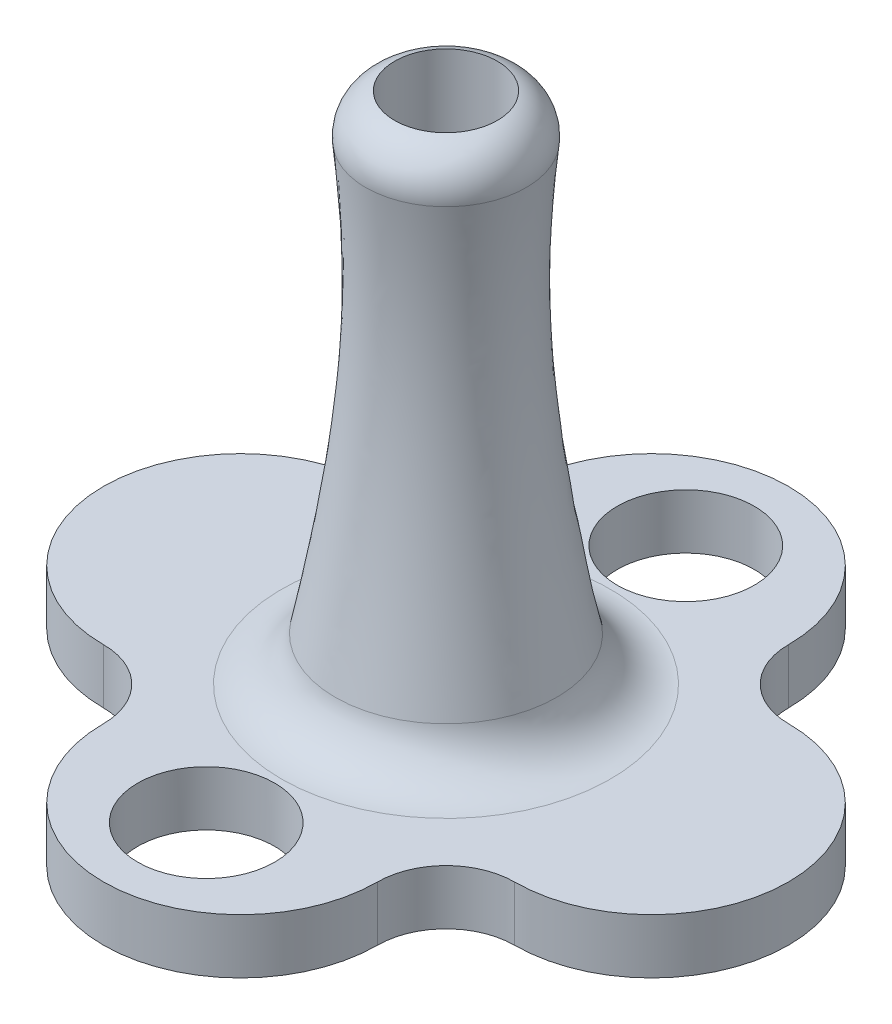
ISO-10303-21;
HEADER;
FILE_DESCRIPTION(('STEP AP214'),'2;1');
FILE_NAME('part.step','',(''),(''),'','','');
FILE_SCHEMA(('AUTOMOTIVE_DESIGN { 1 0 10303 214 1 1 1 1 }'));
ENDSEC;
DATA;
#1=APPLICATION_CONTEXT('core data for automotive mechanical design processes');
#2=APPLICATION_PROTOCOL_DEFINITION('international standard','automotive_design',2000,#1);
#3=PRODUCT_CONTEXT('',#1,'mechanical');
#4=PRODUCT('Part','Part','',(#3));
#5=PRODUCT_RELATED_PRODUCT_CATEGORY('part','',(#4));
#6=PRODUCT_DEFINITION_FORMATION('','',#4);
#7=PRODUCT_DEFINITION_CONTEXT('part definition',#1,'design');
#8=PRODUCT_DEFINITION('design','',#6,#7);
#9=PRODUCT_DEFINITION_SHAPE('','',#8);
#10=(LENGTH_UNIT() NAMED_UNIT(*) SI_UNIT(.MILLI.,.METRE.));
#11=(NAMED_UNIT(*) PLANE_ANGLE_UNIT() SI_UNIT($,.RADIAN.));
#12=(NAMED_UNIT(*) SI_UNIT($,.STERADIAN.) SOLID_ANGLE_UNIT());
#13=UNCERTAINTY_MEASURE_WITH_UNIT(LENGTH_MEASURE(1.E-05),#10,'distance_accuracy_value','');
#14=(GEOMETRIC_REPRESENTATION_CONTEXT(3) GLOBAL_UNCERTAINTY_ASSIGNED_CONTEXT((#13)) GLOBAL_UNIT_ASSIGNED_CONTEXT((#10,
#11,#12)) REPRESENTATION_CONTEXT('',''));
#15=CARTESIAN_POINT('',(0.,0.,0.));
#16=DIRECTION('',(0.,0.,1.));
#17=DIRECTION('',(1.,0.,0.));
#18=AXIS2_PLACEMENT_3D('',#15,#16,#17);
#19=CARTESIAN_POINT('',(0.,2.032,7.61999999999999));
#20=DIRECTION('',(0.,1.,0.));
#21=DIRECTION('',(0.,0.,1.));
#22=AXIS2_PLACEMENT_3D('',#19,#20,#21);
#23=PLANE('',#22);
#24=CARTESIAN_POINT('',(0.,2.032,0.));
#25=DIRECTION('',(0.,1.,0.));
#26=DIRECTION('',(0.,0.,1.));
#27=AXIS2_PLACEMENT_3D('',#24,#25,#26);
#28=CIRCLE('',#27,6.09672311357425);
#29=CARTESIAN_POINT('',(0.,2.032,6.09672311357425));
#30=VERTEX_POINT('',#29);
#31=EDGE_CURVE('E45',#30,#30,#28,.F.);
#32=ORIENTED_EDGE('',*,*,#31,.T.);
#33=EDGE_LOOP('',(#32));
#34=FACE_BOUND('',#33,.T.);
#35=CARTESIAN_POINT('',(0.,2.032,8.88999999999999));
#36=DIRECTION('',(0.,1.,0.));
#37=DIRECTION('',(0.,0.,-1.));
#38=AXIS2_PLACEMENT_3D('',#35,#36,#37);
#39=CIRCLE('',#38,2.54);
#40=CARTESIAN_POINT('',(0.,2.032,6.34999999999999));
#41=VERTEX_POINT('',#40);
#42=EDGE_CURVE('E258',#41,#41,#39,.T.);
#43=ORIENTED_EDGE('',*,*,#42,.F.);
#44=EDGE_LOOP('',(#43));
#45=FACE_BOUND('',#44,.T.);
#46=CARTESIAN_POINT('',(0.,2.032,-8.88999999999999));
#47=DIRECTION('',(0.,1.,0.));
#48=DIRECTION('',(0.,0.,1.));
#49=AXIS2_PLACEMENT_3D('',#46,#47,#48);
#50=CIRCLE('',#49,2.54);
#51=CARTESIAN_POINT('',(0.,2.032,-6.34999999999999));
#52=VERTEX_POINT('',#51);
#53=EDGE_CURVE('E252',#52,#52,#50,.T.);
#54=ORIENTED_EDGE('',*,*,#53,.F.);
#55=EDGE_LOOP('',(#54));
#56=FACE_BOUND('',#55,.T.);
#57=CARTESIAN_POINT('',(0.,2.032,7.61999999999999));
#58=DIRECTION('',(0.,1.,0.));
#59=DIRECTION('',(0.,0.,1.));
#60=AXIS2_PLACEMENT_3D('',#57,#58,#59);
#61=CIRCLE('',#60,5.08);
#62=CARTESIAN_POINT('',(-5.08,2.032,7.61999999999999));
#63=VERTEX_POINT('',#62);
#64=CARTESIAN_POINT('',(5.08,2.032,7.61999999999999));
#65=VERTEX_POINT('',#64);
#66=EDGE_CURVE('E92',#63,#65,#61,.T.);
#67=ORIENTED_EDGE('',*,*,#66,.T.);
#68=CARTESIAN_POINT('',(7.62,2.032,7.62));
#69=DIRECTION('',(0.,1.,0.));
#70=DIRECTION('',(0.,0.,1.));
#71=AXIS2_PLACEMENT_3D('',#68,#69,#70);
#72=CIRCLE('',#71,2.54);
#73=CARTESIAN_POINT('',(7.61999999999999,2.032,5.08));
#74=VERTEX_POINT('',#73);
#75=EDGE_CURVE('E149',#65,#74,#72,.F.);
#76=ORIENTED_EDGE('',*,*,#75,.T.);
#77=CARTESIAN_POINT('',(7.61999999999999,2.032,0.));
#78=DIRECTION('',(0.,1.,0.));
#79=DIRECTION('',(0.,0.,1.));
#80=AXIS2_PLACEMENT_3D('',#77,#78,#79);
#81=CIRCLE('',#80,5.08);
#82=CARTESIAN_POINT('',(7.61999999999999,2.032,-5.08));
#83=VERTEX_POINT('',#82);
#84=EDGE_CURVE('E221',#74,#83,#81,.T.);
#85=ORIENTED_EDGE('',*,*,#84,.T.);
#86=CARTESIAN_POINT('',(7.62,2.032,-7.62));
#87=DIRECTION('',(0.,1.,0.));
#88=DIRECTION('',(0.,0.,1.));
#89=AXIS2_PLACEMENT_3D('',#86,#87,#88);
#90=CIRCLE('',#89,2.54);
#91=CARTESIAN_POINT('',(5.08,2.032,-7.61999999999999));
#92=VERTEX_POINT('',#91);
#93=EDGE_CURVE('E153',#83,#92,#90,.F.);
#94=ORIENTED_EDGE('',*,*,#93,.T.);
#95=CARTESIAN_POINT('',(0.,2.032,-7.61999999999999));
#96=DIRECTION('',(0.,1.,0.));
#97=DIRECTION('',(0.,0.,1.));
#98=AXIS2_PLACEMENT_3D('',#95,#96,#97);
#99=CIRCLE('',#98,5.08);
#100=CARTESIAN_POINT('',(-5.08,2.032,-7.61999999999999));
#101=VERTEX_POINT('',#100);
#102=EDGE_CURVE('E111',#92,#101,#99,.T.);
#103=ORIENTED_EDGE('',*,*,#102,.T.);
#104=CARTESIAN_POINT('',(-7.62,2.032,-7.62));
#105=DIRECTION('',(0.,1.,0.));
#106=DIRECTION('',(0.,0.,1.));
#107=AXIS2_PLACEMENT_3D('',#104,#105,#106);
#108=CIRCLE('',#107,2.54);
#109=CARTESIAN_POINT('',(-7.61999999999999,2.032,-5.08));
#110=VERTEX_POINT('',#109);
#111=EDGE_CURVE('E106',#101,#110,#108,.F.);
#112=ORIENTED_EDGE('',*,*,#111,.T.);
#113=CARTESIAN_POINT('',(-7.61999999999999,2.032,0.));
#114=DIRECTION('',(0.,1.,0.));
#115=DIRECTION('',(0.,0.,1.));
#116=AXIS2_PLACEMENT_3D('',#113,#114,#115);
#117=CIRCLE('',#116,5.08);
#118=CARTESIAN_POINT('',(-7.61999999999999,2.032,5.08));
#119=VERTEX_POINT('',#118);
#120=EDGE_CURVE('E108',#110,#119,#117,.T.);
#121=ORIENTED_EDGE('',*,*,#120,.T.);
#122=CARTESIAN_POINT('',(-7.62,2.032,7.62));
#123=DIRECTION('',(0.,1.,0.));
#124=DIRECTION('',(0.,0.,1.));
#125=AXIS2_PLACEMENT_3D('',#122,#123,#124);
#126=CIRCLE('',#125,2.54);
#127=EDGE_CURVE('E53',#119,#63,#126,.F.);
#128=ORIENTED_EDGE('',*,*,#127,.T.);
#129=EDGE_LOOP('',(#67,#76,#85,#94,#103,#112,#121,#128));
#130=FACE_BOUND('',#129,.T.);
#131=ADVANCED_FACE('F36',(#34,#45,#56,#130),#23,.T.);
#132=CARTESIAN_POINT('',(0.,2.032,7.61999999999999));
#133=DIRECTION('',(0.,-1.,0.));
#134=DIRECTION('',(0.,0.,-1.));
#135=AXIS2_PLACEMENT_3D('',#132,#133,#134);
#136=CYLINDRICAL_SURFACE('',#135,5.08);
#137=CARTESIAN_POINT('',(0.,0.,7.61999999999999));
#138=DIRECTION('',(0.,1.,0.));
#139=DIRECTION('',(0.,0.,1.));
#140=AXIS2_PLACEMENT_3D('',#137,#138,#139);
#141=CIRCLE('',#140,5.08);
#142=CARTESIAN_POINT('',(-5.08,0.,7.61999999999999));
#143=VERTEX_POINT('',#142);
#144=CARTESIAN_POINT('',(5.08,0.,7.61999999999999));
#145=VERTEX_POINT('',#144);
#146=EDGE_CURVE('E232',#143,#145,#141,.T.);
#147=ORIENTED_EDGE('',*,*,#146,.T.);
#148=DIRECTION('',(0.,-1.,0.));
#149=VECTOR('',#148,1.);
#150=CARTESIAN_POINT('',(5.08,2.032,7.61999999999999));
#151=LINE('',#150,#149);
#152=EDGE_CURVE('E141',#65,#145,#151,.T.);
#153=ORIENTED_EDGE('',*,*,#152,.F.);
#154=ORIENTED_EDGE('',*,*,#66,.F.);
#155=DIRECTION('',(0.,-1.,0.));
#156=VECTOR('',#155,1.);
#157=CARTESIAN_POINT('',(-5.08,2.032,7.61999999999999));
#158=LINE('',#157,#156);
#159=EDGE_CURVE('E123',#63,#143,#158,.T.);
#160=ORIENTED_EDGE('',*,*,#159,.T.);
#161=EDGE_LOOP('',(#147,#153,#154,#160));
#162=FACE_BOUND('',#161,.T.);
#163=ADVANCED_FACE('F188',(#162),#136,.T.);
#164=CARTESIAN_POINT('',(7.61999999999999,2.032,0.));
#165=DIRECTION('',(0.,-1.,0.));
#166=DIRECTION('',(0.,0.,-1.));
#167=AXIS2_PLACEMENT_3D('',#164,#165,#166);
#168=CYLINDRICAL_SURFACE('',#167,5.08);
#169=CARTESIAN_POINT('',(7.61999999999999,0.,0.));
#170=DIRECTION('',(0.,1.,0.));
#171=DIRECTION('',(0.,0.,1.));
#172=AXIS2_PLACEMENT_3D('',#169,#170,#171);
#173=CIRCLE('',#172,5.08);
#174=CARTESIAN_POINT('',(7.61999999999999,0.,5.08));
#175=VERTEX_POINT('',#174);
#176=CARTESIAN_POINT('',(7.61999999999999,0.,-5.08));
#177=VERTEX_POINT('',#176);
#178=EDGE_CURVE('E235',#175,#177,#173,.T.);
#179=ORIENTED_EDGE('',*,*,#178,.T.);
#180=DIRECTION('',(0.,-1.,0.));
#181=VECTOR('',#180,1.);
#182=CARTESIAN_POINT('',(7.61999999999999,2.032,-5.08));
#183=LINE('',#182,#181);
#184=EDGE_CURVE('E135',#83,#177,#183,.T.);
#185=ORIENTED_EDGE('',*,*,#184,.F.);
#186=ORIENTED_EDGE('',*,*,#84,.F.);
#187=DIRECTION('',(0.,-1.,0.));
#188=VECTOR('',#187,1.);
#189=CARTESIAN_POINT('',(7.61999999999999,2.032,5.08));
#190=LINE('',#189,#188);
#191=EDGE_CURVE('E138',#74,#175,#190,.T.);
#192=ORIENTED_EDGE('',*,*,#191,.T.);
#193=EDGE_LOOP('',(#179,#185,#186,#192));
#194=FACE_BOUND('',#193,.T.);
#195=ADVANCED_FACE('F192',(#194),#168,.T.);
#196=CARTESIAN_POINT('',(0.,2.032,-7.61999999999999));
#197=DIRECTION('',(0.,-1.,0.));
#198=DIRECTION('',(0.,0.,-1.));
#199=AXIS2_PLACEMENT_3D('',#196,#197,#198);
#200=CYLINDRICAL_SURFACE('',#199,5.08);
#201=CARTESIAN_POINT('',(0.,0.,-7.61999999999999));
#202=DIRECTION('',(0.,1.,0.));
#203=DIRECTION('',(0.,0.,1.));
#204=AXIS2_PLACEMENT_3D('',#201,#202,#203);
#205=CIRCLE('',#204,5.08);
#206=CARTESIAN_POINT('',(5.08,0.,-7.61999999999999));
#207=VERTEX_POINT('',#206);
#208=CARTESIAN_POINT('',(-5.08,0.,-7.61999999999999));
#209=VERTEX_POINT('',#208);
#210=EDGE_CURVE('E238',#207,#209,#205,.T.);
#211=ORIENTED_EDGE('',*,*,#210,.T.);
#212=DIRECTION('',(0.,-1.,0.));
#213=VECTOR('',#212,1.);
#214=CARTESIAN_POINT('',(-5.08,2.032,-7.61999999999999));
#215=LINE('',#214,#213);
#216=EDGE_CURVE('E126',#101,#209,#215,.T.);
#217=ORIENTED_EDGE('',*,*,#216,.F.);
#218=ORIENTED_EDGE('',*,*,#102,.F.);
#219=DIRECTION('',(0.,-1.,0.));
#220=VECTOR('',#219,1.);
#221=CARTESIAN_POINT('',(5.08,2.032,-7.61999999999999));
#222=LINE('',#221,#220);
#223=EDGE_CURVE('E128',#92,#207,#222,.T.);
#224=ORIENTED_EDGE('',*,*,#223,.T.);
#225=EDGE_LOOP('',(#211,#217,#218,#224));
#226=FACE_BOUND('',#225,.T.);
#227=ADVANCED_FACE('F202',(#226),#200,.T.);
#228=CARTESIAN_POINT('',(-7.61999999999999,2.032,0.));
#229=DIRECTION('',(0.,-1.,0.));
#230=DIRECTION('',(0.,0.,-1.));
#231=AXIS2_PLACEMENT_3D('',#228,#229,#230);
#232=CYLINDRICAL_SURFACE('',#231,5.08);
#233=CARTESIAN_POINT('',(-7.61999999999999,0.,0.));
#234=DIRECTION('',(0.,1.,0.));
#235=DIRECTION('',(0.,0.,1.));
#236=AXIS2_PLACEMENT_3D('',#233,#234,#235);
#237=CIRCLE('',#236,5.08);
#238=CARTESIAN_POINT('',(-7.61999999999999,0.,-5.08));
#239=VERTEX_POINT('',#238);
#240=CARTESIAN_POINT('',(-7.61999999999999,0.,5.08));
#241=VERTEX_POINT('',#240);
#242=EDGE_CURVE('E228',#239,#241,#237,.T.);
#243=ORIENTED_EDGE('',*,*,#242,.T.);
#244=DIRECTION('',(0.,-1.,0.));
#245=VECTOR('',#244,1.);
#246=CARTESIAN_POINT('',(-7.61999999999999,2.032,5.08));
#247=LINE('',#246,#245);
#248=EDGE_CURVE('E122',#119,#241,#247,.T.);
#249=ORIENTED_EDGE('',*,*,#248,.F.);
#250=ORIENTED_EDGE('',*,*,#120,.F.);
#251=DIRECTION('',(0.,-1.,0.));
#252=VECTOR('',#251,1.);
#253=CARTESIAN_POINT('',(-7.61999999999999,2.032,-5.08));
#254=LINE('',#253,#252);
#255=EDGE_CURVE('E121',#110,#239,#254,.T.);
#256=ORIENTED_EDGE('',*,*,#255,.T.);
#257=EDGE_LOOP('',(#243,#249,#250,#256));
#258=FACE_BOUND('',#257,.T.);
#259=ADVANCED_FACE('F120',(#258),#232,.T.);
#260=CARTESIAN_POINT('',(0.,0.,7.61999999999999));
#261=DIRECTION('',(0.,1.,0.));
#262=DIRECTION('',(0.,0.,1.));
#263=AXIS2_PLACEMENT_3D('',#260,#261,#262);
#264=PLANE('',#263);
#265=CARTESIAN_POINT('',(0.,0.,8.88999999999999));
#266=DIRECTION('',(0.,1.,0.));
#267=DIRECTION('',(0.,0.,1.));
#268=AXIS2_PLACEMENT_3D('',#265,#266,#267);
#269=CIRCLE('',#268,2.54);
#270=CARTESIAN_POINT('',(0.,0.,11.43));
#271=VERTEX_POINT('',#270);
#272=EDGE_CURVE('E255',#271,#271,#269,.F.);
#273=ORIENTED_EDGE('',*,*,#272,.F.);
#274=EDGE_LOOP('',(#273));
#275=FACE_BOUND('',#274,.T.);
#276=CARTESIAN_POINT('',(0.,0.,-8.88999999999999));
#277=DIRECTION('',(0.,1.,0.));
#278=DIRECTION('',(0.,0.,1.));
#279=AXIS2_PLACEMENT_3D('',#276,#277,#278);
#280=CIRCLE('',#279,2.54);
#281=CARTESIAN_POINT('',(0.,0.,-6.34999999999999));
#282=VERTEX_POINT('',#281);
#283=EDGE_CURVE('E247',#282,#282,#280,.F.);
#284=ORIENTED_EDGE('',*,*,#283,.F.);
#285=EDGE_LOOP('',(#284));
#286=FACE_BOUND('',#285,.T.);
#287=ORIENTED_EDGE('',*,*,#146,.F.);
#288=CARTESIAN_POINT('',(-7.62,0.,7.62));
#289=DIRECTION('',(0.,1.,0.));
#290=DIRECTION('',(0.,0.,1.));
#291=AXIS2_PLACEMENT_3D('',#288,#289,#290);
#292=CIRCLE('',#291,2.54);
#293=EDGE_CURVE('E82',#143,#241,#292,.T.);
#294=ORIENTED_EDGE('',*,*,#293,.T.);
#295=ORIENTED_EDGE('',*,*,#242,.F.);
#296=CARTESIAN_POINT('',(-7.62,0.,-7.62));
#297=DIRECTION('',(0.,1.,0.));
#298=DIRECTION('',(0.,0.,1.));
#299=AXIS2_PLACEMENT_3D('',#296,#297,#298);
#300=CIRCLE('',#299,2.54);
#301=EDGE_CURVE('E116',#239,#209,#300,.T.);
#302=ORIENTED_EDGE('',*,*,#301,.T.);
#303=ORIENTED_EDGE('',*,*,#210,.F.);
#304=CARTESIAN_POINT('',(7.62,0.,-7.62));
#305=DIRECTION('',(0.,1.,0.));
#306=DIRECTION('',(0.,0.,1.));
#307=AXIS2_PLACEMENT_3D('',#304,#305,#306);
#308=CIRCLE('',#307,2.54);
#309=EDGE_CURVE('E151',#207,#177,#308,.T.);
#310=ORIENTED_EDGE('',*,*,#309,.T.);
#311=ORIENTED_EDGE('',*,*,#178,.F.);
#312=CARTESIAN_POINT('',(7.62,0.,7.62));
#313=DIRECTION('',(0.,1.,0.));
#314=DIRECTION('',(0.,0.,1.));
#315=AXIS2_PLACEMENT_3D('',#312,#313,#314);
#316=CIRCLE('',#315,2.54);
#317=EDGE_CURVE('E147',#175,#145,#316,.T.);
#318=ORIENTED_EDGE('',*,*,#317,.T.);
#319=EDGE_LOOP('',(#287,#294,#295,#302,#303,#310,#311,#318));
#320=FACE_BOUND('',#319,.T.);
#321=ADVANCED_FACE('F196',(#275,#286,#320),#264,.F.);
#322=CARTESIAN_POINT('',(-7.62,2.032,-7.62));
#323=DIRECTION('',(0.,1.,0.));
#324=DIRECTION('',(0.,0.,1.));
#325=AXIS2_PLACEMENT_3D('',#322,#323,#324);
#326=CYLINDRICAL_SURFACE('',#325,2.54);
#327=ORIENTED_EDGE('',*,*,#111,.F.);
#328=ORIENTED_EDGE('',*,*,#216,.T.);
#329=ORIENTED_EDGE('',*,*,#301,.F.);
#330=ORIENTED_EDGE('',*,*,#255,.F.);
#331=EDGE_LOOP('',(#327,#328,#329,#330));
#332=FACE_BOUND('',#331,.T.);
#333=ADVANCED_FACE('F125',(#332),#326,.F.);
#334=CARTESIAN_POINT('',(-7.62,2.032,7.62));
#335=DIRECTION('',(0.,1.,0.));
#336=DIRECTION('',(0.,0.,1.));
#337=AXIS2_PLACEMENT_3D('',#334,#335,#336);
#338=CYLINDRICAL_SURFACE('',#337,2.54);
#339=ORIENTED_EDGE('',*,*,#127,.F.);
#340=ORIENTED_EDGE('',*,*,#248,.T.);
#341=ORIENTED_EDGE('',*,*,#293,.F.);
#342=ORIENTED_EDGE('',*,*,#159,.F.);
#343=EDGE_LOOP('',(#339,#340,#341,#342));
#344=FACE_BOUND('',#343,.T.);
#345=ADVANCED_FACE('F211',(#344),#338,.F.);
#346=CARTESIAN_POINT('',(7.62,2.032,7.62));
#347=DIRECTION('',(0.,1.,0.));
#348=DIRECTION('',(0.,0.,1.));
#349=AXIS2_PLACEMENT_3D('',#346,#347,#348);
#350=CYLINDRICAL_SURFACE('',#349,2.54);
#351=ORIENTED_EDGE('',*,*,#75,.F.);
#352=ORIENTED_EDGE('',*,*,#152,.T.);
#353=ORIENTED_EDGE('',*,*,#317,.F.);
#354=ORIENTED_EDGE('',*,*,#191,.F.);
#355=EDGE_LOOP('',(#351,#352,#353,#354));
#356=FACE_BOUND('',#355,.T.);
#357=ADVANCED_FACE('F181',(#356),#350,.F.);
#358=CARTESIAN_POINT('',(7.62,2.032,-7.62));
#359=DIRECTION('',(0.,1.,0.));
#360=DIRECTION('',(0.,0.,1.));
#361=AXIS2_PLACEMENT_3D('',#358,#359,#360);
#362=CYLINDRICAL_SURFACE('',#361,2.54);
#363=ORIENTED_EDGE('',*,*,#93,.F.);
#364=ORIENTED_EDGE('',*,*,#184,.T.);
#365=ORIENTED_EDGE('',*,*,#309,.F.);
#366=ORIENTED_EDGE('',*,*,#223,.F.);
#367=EDGE_LOOP('',(#363,#364,#365,#366));
#368=FACE_BOUND('',#367,.T.);
#369=ADVANCED_FACE('F171',(#368),#362,.F.);
#370=CARTESIAN_POINT('',(-4.4123574666858,2.032,0.537704924825917));
#371=CARTESIAN_POINT('',(0.0179541063269482,21.082,3.17494923582504));
#372=CARTESIAN_POINT('',(-3.33694761703397,2.032,9.36241985819753));
#373=CARTESIAN_POINT('',(6.36785257797703,21.082,3.13904102317114));
#374=CARTESIAN_POINT('',(5.48776731633765,2.032,8.28701000854569));
#375=CARTESIAN_POINT('',(6.33194436532313,21.082,-3.21085744847893));
#376=CARTESIAN_POINT('',(4.4123574666858,2.032,-0.537704924825922));
#377=CARTESIAN_POINT('',(-0.0179541063269475,21.082,-3.17494923582504));
#378=CARTESIAN_POINT('',(3.33694761703396,2.032,-9.36241985819752));
#379=CARTESIAN_POINT('',(-6.36785257797703,21.082,-3.13904102317114));
#380=CARTESIAN_POINT('',(-5.48776731633764,2.032,-8.28701000854568));
#381=CARTESIAN_POINT('',(-6.33194436532313,21.082,3.21085744847894));
#382=CARTESIAN_POINT('',(-4.4123574666858,2.032,0.537704924825917));
#383=CARTESIAN_POINT('',(0.0179541063269482,21.082,3.17494923582504));
#384=(BOUNDED_SURFACE() B_SPLINE_SURFACE(3,1,((#370,#371),(#372,#373),(#374,#375),(#376,#377),
(#378,#379),(#380,#381),(#382,#383)),.UNSPECIFIED.,.T.,.F.,.F.) B_SPLINE_SURFACE_WITH_KNOTS((4,
3,4),(2,2),(0.,0.5,1.),(0.,1.),
.UNSPECIFIED.) GEOMETRIC_REPRESENTATION_ITEM() RATIONAL_B_SPLINE_SURFACE(((1.,1.),
(0.333333333333333,0.333333333333333),(0.333333333333333,0.333333333333333),(1.,1.),
(0.333333333333333,0.333333333333333),(0.333333333333333,0.333333333333333),(1.,1.))) REPRESENTATION_ITEM('') SURFACE());
#385=CARTESIAN_POINT('',(0.,19.4596831952884,0.));
#386=DIRECTION('',(0.,1.,0.));
#387=DIRECTION('',(0.,0.,1.));
#388=AXIS2_PLACEMENT_3D('',#385,#386,#387);
#389=CIRCLE('',#388,2.97216078871544);
#390=CARTESIAN_POINT('',(-0.359335600497549,19.4596831952884,2.95035890701329));
#391=VERTEX_POINT('',#390);
#392=EDGE_CURVE('E12',#391,#391,#389,.F.);
#393=CARTESIAN_POINT('',(0.,3.66017879877707,0.));
#394=DIRECTION('',(0.,1.,0.));
#395=DIRECTION('',(0.,0.,1.));
#396=AXIS2_PLACEMENT_3D('',#393,#394,#395);
#397=CIRCLE('',#396,4.1052531947849);
#398=CARTESIAN_POINT('',(-4.03370448111331,3.66017879877707,0.763106776498579));
#399=VERTEX_POINT('',#398);
#400=EDGE_CURVE('E155',#399,#399,#397,.T.);
#401=CARTESIAN_POINT('',(-0.359335600497549,19.4596831952884,2.95035890701329));
#402=CARTESIAN_POINT('',(-0.397610276337297,19.2951050244915,2.92757503065376));
#403=CARTESIAN_POINT('',(-0.435884952177044,19.1305268536945,2.90479115429423));
#404=CARTESIAN_POINT('',(-0.512434303856539,18.8013705121005,2.85922340157518));
#405=CARTESIAN_POINT('',(-0.550708979696287,18.6367923413035,2.83643952521565));
#406=CARTESIAN_POINT('',(-0.627258331375782,18.3076359997095,2.79087177249659));
#407=CARTESIAN_POINT('',(-0.665533007215529,18.1430578289125,2.76808789613706));
#408=CARTESIAN_POINT('',(-0.742082358895024,17.8139014873185,2.72252014341801));
#409=CARTESIAN_POINT('',(-0.780357034734772,17.6493233165215,2.69973626705848));
#410=CARTESIAN_POINT('',(-0.856906386414267,17.3201669749275,2.65416851433942));
#411=CARTESIAN_POINT('',(-0.895181062254014,17.1555888041305,2.63138463797989));
#412=CARTESIAN_POINT('',(-0.971730413933509,16.8264324625365,2.58581688526084));
#413=CARTESIAN_POINT('',(-1.01000508977326,16.6618542917396,2.56303300890131));
#414=CARTESIAN_POINT('',(-1.08655444145275,16.3326979501456,2.51746525618225));
#415=CARTESIAN_POINT('',(-1.1248291172925,16.1681197793486,2.49468137982272));
#416=CARTESIAN_POINT('',(-1.20137846897199,15.8389634377546,2.44911362710367));
#417=CARTESIAN_POINT('',(-1.23965314481174,15.6743852669576,2.42632975074414));
#418=CARTESIAN_POINT('',(-1.31620249649124,15.3452289253636,2.38076199802508));
#419=CARTESIAN_POINT('',(-1.35447717233098,15.1806507545666,2.35797812166556));
#420=CARTESIAN_POINT('',(-1.43102652401048,14.8514944129726,2.3124103689465));
#421=CARTESIAN_POINT('',(-1.46930119985023,14.6869162421756,2.28962649258697));
#422=CARTESIAN_POINT('',(-1.54585055152972,14.3577599005816,2.24405873986791));
#423=CARTESIAN_POINT('',(-1.58412522736947,14.1931817297846,2.22127486350839));
#424=CARTESIAN_POINT('',(-1.66067457904896,13.8640253881907,2.17570711078933));
#425=CARTESIAN_POINT('',(-1.69894925488871,13.6994472173937,2.1529232344298));
#426=CARTESIAN_POINT('',(-1.77549860656821,13.3702908757997,2.10735548171074));
#427=CARTESIAN_POINT('',(-1.81377328240795,13.2057127050027,2.08457160535122));
#428=CARTESIAN_POINT('',(-1.89032263408745,12.8765563634087,2.03900385263216));
#429=CARTESIAN_POINT('',(-1.9285973099272,12.7119781926117,2.01621997627263));
#430=CARTESIAN_POINT('',(-2.00514666160669,12.3828218510177,1.97065222355358));
#431=CARTESIAN_POINT('',(-2.04342133744644,12.2182436802207,1.94786834719405));
#432=CARTESIAN_POINT('',(-2.11997068912593,11.8890873386267,1.90230059447499));
#433=CARTESIAN_POINT('',(-2.15824536496568,11.7245091678297,1.87951671811546));
#434=CARTESIAN_POINT('',(-2.23479471664518,11.3953528262358,1.83394896539641));
#435=CARTESIAN_POINT('',(-2.27306939248492,11.2307746554388,1.81116508903688));
#436=CARTESIAN_POINT('',(-2.34961874416442,10.9016183138448,1.76559733631782));
#437=CARTESIAN_POINT('',(-2.38789342000417,10.7370401430478,1.74281345995829));
#438=CARTESIAN_POINT('',(-2.46444277168366,10.4078838014538,1.69724570723924));
#439=CARTESIAN_POINT('',(-2.50271744752341,10.2433056306568,1.67446183087971));
#440=CARTESIAN_POINT('',(-2.5792667992029,9.91414928906282,1.62889407816065));
#441=CARTESIAN_POINT('',(-2.61754147504265,9.74957111826583,1.60611020180112));
#442=CARTESIAN_POINT('',(-2.69409082672215,9.42041477667184,1.56054244908207));
#443=CARTESIAN_POINT('',(-2.73236550256189,9.25583660587484,1.53775857272254));
#444=CARTESIAN_POINT('',(-2.80891485424139,8.92668026428086,1.49219082000348));
#445=CARTESIAN_POINT('',(-2.84718953008113,8.76210209348386,1.46940694364395));
#446=CARTESIAN_POINT('',(-2.92373888176063,8.43294575188987,1.4238391909249));
#447=CARTESIAN_POINT('',(-2.96201355760038,8.26836758109288,1.40105531456537));
#448=CARTESIAN_POINT('',(-3.03856290927987,7.93921123949889,1.35548756184631));
#449=CARTESIAN_POINT('',(-3.07683758511962,7.7746330687019,1.33270368548678));
#450=CARTESIAN_POINT('',(-3.15338693679911,7.44547672710792,1.28713593276773));
#451=CARTESIAN_POINT('',(-3.19166161263886,7.28089855631092,1.2643520564082));
#452=CARTESIAN_POINT('',(-3.26821096431836,6.95174221471693,1.21878430368914));
#453=CARTESIAN_POINT('',(-3.30648564015811,6.78716404391994,1.19600042732962));
#454=CARTESIAN_POINT('',(-3.3830349918376,6.45800770232595,1.15043267461056));
#455=CARTESIAN_POINT('',(-3.42130966767735,6.29342953152896,1.12764879825103));
#456=CARTESIAN_POINT('',(-3.49785901935684,5.96427318993497,1.08208104553197));
#457=CARTESIAN_POINT('',(-3.53613369519659,5.79969501913798,1.05929716917245));
#458=CARTESIAN_POINT('',(-3.61268304687608,5.47053867754399,1.01372941645339));
#459=CARTESIAN_POINT('',(-3.65095772271583,5.305960506747,0.990945540093861));
#460=CARTESIAN_POINT('',(-3.72750707439533,4.97680416515301,0.945377787374804));
#461=CARTESIAN_POINT('',(-3.76578175023507,4.81222599435602,0.922593911015276));
#462=CARTESIAN_POINT('',(-3.84233110191457,4.48306965276203,0.87702615829622));
#463=CARTESIAN_POINT('',(-3.88060577775432,4.31849148196504,0.854242281936692));
#464=CARTESIAN_POINT('',(-3.95715512943381,3.98933514037105,0.808674529217635));
#465=CARTESIAN_POINT('',(-3.99542980527356,3.82475696957406,0.785890652858107));
#466=CARTESIAN_POINT('',(-4.03370448111331,3.66017879877706,0.763106776498579));
#467=B_SPLINE_CURVE_WITH_KNOTS('',3,(#401,#402,#403,#404,#405,#406,#407,#408,#409,#410,#411,
#412,#413,#414,#415,#416,#417,#418,#419,#420,#421,#422,#423,#424,#425,#426,#427,#428,#429,#430,
#431,#432,#433,#434,#435,#436,#437,#438,#439,#440,#441,#442,#443,#444,#445,#446,#447,#448,#449,
#450,#451,#452,#453,#454,#455,#456,#457,#458,#459,#460,#461,#462,#463,#464,#465,#466),
.UNSPECIFIED.,.F.,.F.,(4,2,2,2,2,2,2,2,2,2,2,2,2,2,2,2,2,2,2,2,2,2,2,2,2,2,2,2,2,2,2,2,4),(0.,
0.511498065704451,1.0229961314089,1.53449419711336,2.04599226281781,2.55749032852226,
3.06898839422671,3.58048645993116,4.09198452563561,4.60348259134006,5.11498065704452,
5.62647872274897,6.13797678845342,6.64947485415787,7.16097291986232,7.67247098556678,
8.18396905127123,8.69546711697568,9.20696518268013,9.71846324838458,10.229961314089,
10.7414593797935,11.2529574454979,11.7644555112024,12.2759535769068,12.7874516426113,
13.2989497083157,13.8104477740202,14.3219458397246,14.8334439054291,15.3449419711335,
15.856440036838,16.3679381025425),.UNSPECIFIED.);
#468=EDGE_CURVE('BSEAM168',#391,#399,#467,.T.);
#469=ORIENTED_EDGE('',*,*,#392,.T.);
#470=ORIENTED_EDGE('',*,*,#400,.T.);
#471=ORIENTED_EDGE('',*,*,#468,.T.);
#472=ORIENTED_EDGE('',*,*,#468,.F.);
#473=EDGE_LOOP('',(#469,#471,#470,#472));
#474=FACE_BOUND('',#473,.T.);
#475=ADVANCED_FACE('F168',(#474),#384,.T.);
#476=CARTESIAN_POINT('',(0.,-3.35615367264149,0.));
#477=DIRECTION('',(0.,1.,0.));
#478=DIRECTION('',(0.,0.,1.));
#479=AXIS2_PLACEMENT_3D('',#476,#477,#478);
#480=CYLINDRICAL_SURFACE('',#479,1.905);
#481=CARTESIAN_POINT('',(0.,2.032,0.));
#482=DIRECTION('',(0.,1.,0.));
#483=DIRECTION('',(0.,0.,1.));
#484=AXIS2_PLACEMENT_3D('',#481,#482,#483);
#485=CIRCLE('',#484,1.905);
#486=CARTESIAN_POINT('',(0.,2.032,1.905));
#487=VERTEX_POINT('',#486);
#488=EDGE_CURVE('E236',#487,#487,#485,.F.);
#489=ORIENTED_EDGE('',*,*,#488,.T.);
#490=EDGE_LOOP('',(#489));
#491=FACE_BOUND('',#490,.T.);
#492=CARTESIAN_POINT('',(0.,21.082,0.));
#493=DIRECTION('',(0.,1.,0.));
#494=DIRECTION('',(0.,0.,1.));
#495=AXIS2_PLACEMENT_3D('',#492,#493,#494);
#496=CIRCLE('',#495,1.905);
#497=CARTESIAN_POINT('',(0.,21.082,1.905));
#498=VERTEX_POINT('',#497);
#499=EDGE_CURVE('E244',#498,#498,#496,.T.);
#500=ORIENTED_EDGE('',*,*,#499,.T.);
#501=EDGE_LOOP('',(#500));
#502=FACE_BOUND('',#501,.T.);
#503=ADVANCED_FACE('F170',(#491,#502),#480,.F.);
#504=CARTESIAN_POINT('',(0.,2.032,7.61999999999999));
#505=DIRECTION('',(0.,1.,0.));
#506=DIRECTION('',(0.,0.,1.));
#507=AXIS2_PLACEMENT_3D('',#504,#505,#506);
#508=PLANE('',#507);
#509=ORIENTED_EDGE('',*,*,#488,.F.);
#510=EDGE_LOOP('',(#509));
#511=FACE_BOUND('',#510,.T.);
#512=ADVANCED_FACE('F178',(#511),#508,.T.);
#513=CARTESIAN_POINT('',(0.,-7.18420489685532,-8.88999999999999));
#514=DIRECTION('',(0.,1.,0.));
#515=DIRECTION('',(0.,0.,1.));
#516=AXIS2_PLACEMENT_3D('',#513,#514,#515);
#517=CYLINDRICAL_SURFACE('',#516,2.54);
#518=ORIENTED_EDGE('',*,*,#283,.T.);
#519=EDGE_LOOP('',(#518));
#520=FACE_BOUND('',#519,.T.);
#521=ORIENTED_EDGE('',*,*,#53,.T.);
#522=EDGE_LOOP('',(#521));
#523=FACE_BOUND('',#522,.T.);
#524=ADVANCED_FACE('F265',(#520,#523),#517,.F.);
#525=CARTESIAN_POINT('',(0.,-7.18420489685532,8.88999999999999));
#526=DIRECTION('',(0.,1.,0.));
#527=DIRECTION('',(0.,0.,1.));
#528=AXIS2_PLACEMENT_3D('',#525,#526,#527);
#529=CYLINDRICAL_SURFACE('',#528,2.54);
#530=ORIENTED_EDGE('',*,*,#272,.T.);
#531=EDGE_LOOP('',(#530));
#532=FACE_BOUND('',#531,.T.);
#533=ORIENTED_EDGE('',*,*,#42,.T.);
#534=EDGE_LOOP('',(#533));
#535=FACE_BOUND('',#534,.T.);
#536=ADVANCED_FACE('F165',(#532,#535),#529,.F.);
#537=CARTESIAN_POINT('',(0.,4.064,0.));
#538=DIRECTION('',(0.,1.,0.));
#539=DIRECTION('',(0.,0.,1.));
#540=AXIS2_PLACEMENT_3D('',#537,#538,#539);
#541=TOROIDAL_SURFACE('',#540,6.09672311357425,2.032);
#542=ORIENTED_EDGE('',*,*,#31,.F.);
#543=EDGE_LOOP('',(#542));
#544=FACE_BOUND('',#543,.T.);
#545=ORIENTED_EDGE('',*,*,#400,.F.);
#546=EDGE_LOOP('',(#545));
#547=FACE_BOUND('',#546,.T.);
#548=ADVANCED_FACE('F162',(#544,#547),#541,.F.);
#549=CARTESIAN_POINT('',(0.,19.6252786852751,0.));
#550=DIRECTION('',(0.,1.,0.));
#551=DIRECTION('',(0.,0.,1.));
#552=AXIS2_PLACEMENT_3D('',#549,#550,#551);
#553=DEGENERATE_TOROIDAL_SURFACE('',#552,1.45718417711509,1.524,.T.);
#554=ORIENTED_EDGE('',*,*,#392,.F.);
#555=EDGE_LOOP('',(#554));
#556=FACE_BOUND('',#555,.T.);
#557=ORIENTED_EDGE('',*,*,#499,.F.);
#558=EDGE_LOOP('',(#557));
#559=FACE_BOUND('',#558,.T.);
#560=ADVANCED_FACE('F38',(#556,#559),#553,.T.);
#561=CLOSED_SHELL('',(#131,#163,#195,#227,#259,#321,#333,#345,#357,#369,#475,#503,#512,#524,
#536,#548,#560));
#562=MANIFOLD_SOLID_BREP('B2',#561);
#563=ADVANCED_BREP_SHAPE_REPRESENTATION('',(#18,#562),#14);
#564=SHAPE_DEFINITION_REPRESENTATION(#9,#563);
ENDSEC;
END-ISO-10303-21;
